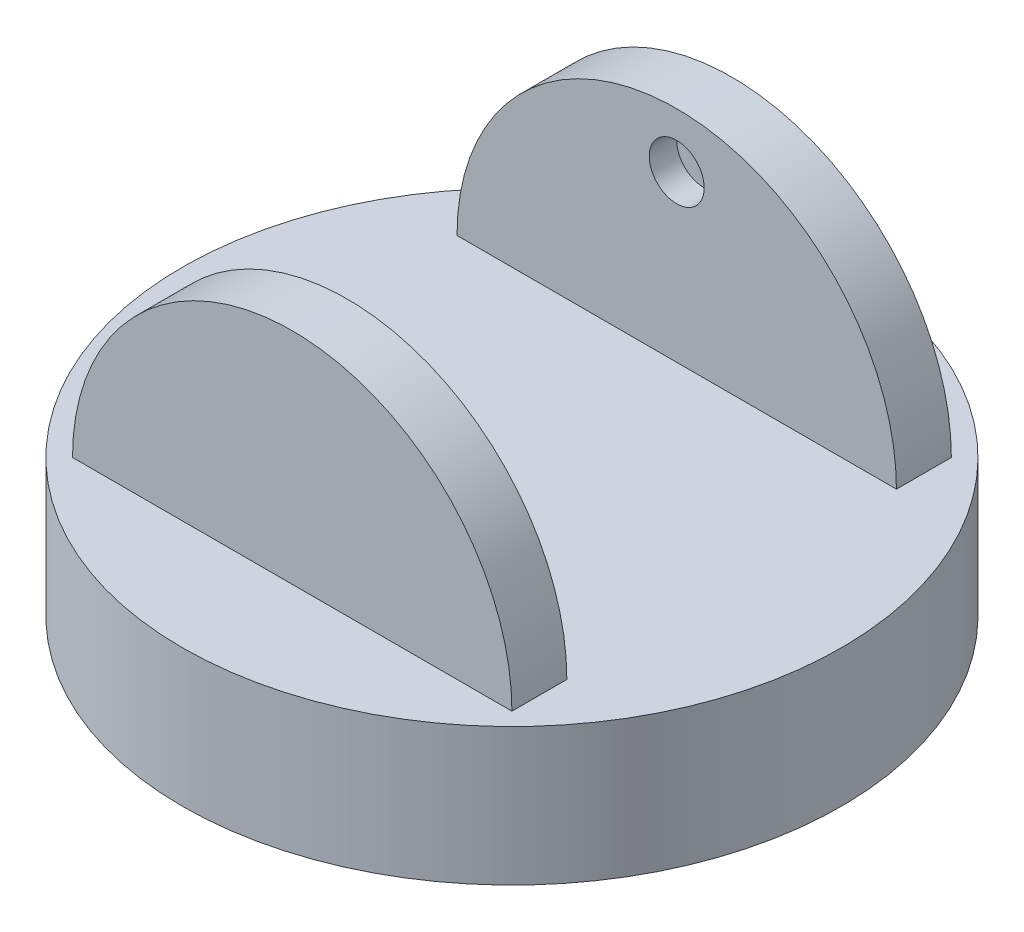
ISO-10303-21;
HEADER;
FILE_DESCRIPTION(('STEP AP214'),'2;1');
FILE_NAME('part.step','',(''),(''),'','','');
FILE_SCHEMA(('AUTOMOTIVE_DESIGN { 1 0 10303 214 1 1 1 1 }'));
ENDSEC;
DATA;
#1=APPLICATION_CONTEXT('core data for automotive mechanical design processes');
#2=APPLICATION_PROTOCOL_DEFINITION('international standard','automotive_design',2000,#1);
#3=PRODUCT_CONTEXT('',#1,'mechanical');
#4=PRODUCT('Part','Part','',(#3));
#5=PRODUCT_RELATED_PRODUCT_CATEGORY('part','',(#4));
#6=PRODUCT_DEFINITION_FORMATION('','',#4);
#7=PRODUCT_DEFINITION_CONTEXT('part definition',#1,'design');
#8=PRODUCT_DEFINITION('design','',#6,#7);
#9=PRODUCT_DEFINITION_SHAPE('','',#8);
#10=(LENGTH_UNIT() NAMED_UNIT(*) SI_UNIT(.MILLI.,.METRE.));
#11=(NAMED_UNIT(*) PLANE_ANGLE_UNIT() SI_UNIT($,.RADIAN.));
#12=(NAMED_UNIT(*) SI_UNIT($,.STERADIAN.) SOLID_ANGLE_UNIT());
#13=UNCERTAINTY_MEASURE_WITH_UNIT(LENGTH_MEASURE(1.E-05),#10,'distance_accuracy_value','');
#14=(GEOMETRIC_REPRESENTATION_CONTEXT(3) GLOBAL_UNCERTAINTY_ASSIGNED_CONTEXT((#13)) GLOBAL_UNIT_ASSIGNED_CONTEXT((#10,
#11,#12)) REPRESENTATION_CONTEXT('',''));
#15=CARTESIAN_POINT('',(0.,0.,0.));
#16=DIRECTION('',(0.,0.,1.));
#17=DIRECTION('',(1.,0.,0.));
#18=AXIS2_PLACEMENT_3D('',#15,#16,#17);
#19=CARTESIAN_POINT('',(0.,25.,40.));
#20=DIRECTION('',(0.,0.,-1.));
#21=DIRECTION('',(-1.,0.,0.));
#22=AXIS2_PLACEMENT_3D('',#19,#20,#21);
#23=CYLINDRICAL_SURFACE('',#22,40.);
#24=CARTESIAN_POINT('',(0.,25.,-30.));
#25=DIRECTION('',(0.,0.,1.));
#26=DIRECTION('',(1.,0.,0.));
#27=AXIS2_PLACEMENT_3D('',#24,#25,#26);
#28=CIRCLE('',#27,40.);
#29=CARTESIAN_POINT('',(40.,25.,-30.));
#30=VERTEX_POINT('',#29);
#31=CARTESIAN_POINT('',(-40.,25.,-30.));
#32=VERTEX_POINT('',#31);
#33=EDGE_CURVE('E11',#30,#32,#28,.T.);
#34=ORIENTED_EDGE('',*,*,#33,.F.);
#35=DIRECTION('',(0.,0.,-1.));
#36=VECTOR('',#35,1.);
#37=CARTESIAN_POINT('',(40.,25.,40.));
#38=LINE('',#37,#36);
#39=CARTESIAN_POINT('',(40.,25.,-40.));
#40=VERTEX_POINT('',#39);
#41=EDGE_CURVE('E80',#30,#40,#38,.T.);
#42=ORIENTED_EDGE('',*,*,#41,.T.);
#43=CARTESIAN_POINT('',(0.,25.,-40.));
#44=DIRECTION('',(0.,0.,1.));
#45=DIRECTION('',(-1.,0.,0.));
#46=AXIS2_PLACEMENT_3D('',#43,#44,#45);
#47=CIRCLE('',#46,40.);
#48=CARTESIAN_POINT('',(-40.,25.,-40.));
#49=VERTEX_POINT('',#48);
#50=EDGE_CURVE('E107',#40,#49,#47,.T.);
#51=ORIENTED_EDGE('',*,*,#50,.T.);
#52=DIRECTION('',(0.,0.,-1.));
#53=VECTOR('',#52,1.);
#54=CARTESIAN_POINT('',(-40.,25.,40.));
#55=LINE('',#54,#53);
#56=EDGE_CURVE('E82',#32,#49,#55,.T.);
#57=ORIENTED_EDGE('',*,*,#56,.F.);
#58=EDGE_LOOP('',(#34,#42,#51,#57));
#59=FACE_BOUND('',#58,.T.);
#60=ADVANCED_FACE('F33',(#59),#23,.T.);
#61=CARTESIAN_POINT('',(0.,25.,30.));
#62=DIRECTION('',(0.,0.,-1.));
#63=DIRECTION('',(-1.,0.,0.));
#64=AXIS2_PLACEMENT_3D('',#61,#62,#63);
#65=CIRCLE('',#64,40.);
#66=CARTESIAN_POINT('',(-40.,25.,30.));
#67=VERTEX_POINT('',#66);
#68=CARTESIAN_POINT('',(40.,25.,30.));
#69=VERTEX_POINT('',#68);
#70=EDGE_CURVE('E41',#67,#69,#65,.T.);
#71=ORIENTED_EDGE('',*,*,#70,.F.);
#72=CARTESIAN_POINT('',(-40.,25.,40.));
#73=VERTEX_POINT('',#72);
#74=EDGE_CURVE('E93',#73,#67,#55,.T.);
#75=ORIENTED_EDGE('',*,*,#74,.F.);
#76=CARTESIAN_POINT('',(0.,25.,40.));
#77=DIRECTION('',(0.,0.,1.));
#78=DIRECTION('',(-1.,0.,0.));
#79=AXIS2_PLACEMENT_3D('',#76,#77,#78);
#80=CIRCLE('',#79,40.);
#81=CARTESIAN_POINT('',(40.,25.,40.));
#82=VERTEX_POINT('',#81);
#83=EDGE_CURVE('E89',#82,#73,#80,.T.);
#84=ORIENTED_EDGE('',*,*,#83,.F.);
#85=EDGE_CURVE('E55',#82,#69,#38,.T.);
#86=ORIENTED_EDGE('',*,*,#85,.T.);
#87=EDGE_LOOP('',(#71,#75,#84,#86));
#88=FACE_BOUND('',#87,.T.);
#89=ADVANCED_FACE('F110',(#88),#23,.T.);
#90=CARTESIAN_POINT('',(0.,25.,0.));
#91=DIRECTION('',(0.,1.,0.));
#92=DIRECTION('',(0.,0.,1.));
#93=AXIS2_PLACEMENT_3D('',#90,#91,#92);
#94=PLANE('',#93);
#95=ORIENTED_EDGE('',*,*,#41,.F.);
#96=DIRECTION('',(-1.,0.,0.));
#97=VECTOR('',#96,1.);
#98=CARTESIAN_POINT('',(-40.,25.,-30.));
#99=LINE('',#98,#97);
#100=EDGE_CURVE('E48',#30,#32,#99,.T.);
#101=ORIENTED_EDGE('',*,*,#100,.T.);
#102=ORIENTED_EDGE('',*,*,#56,.T.);
#103=DIRECTION('',(1.,0.,0.));
#104=VECTOR('',#103,1.);
#105=CARTESIAN_POINT('',(0.,25.,-40.));
#106=LINE('',#105,#104);
#107=EDGE_CURVE('E86',#49,#40,#106,.T.);
#108=ORIENTED_EDGE('',*,*,#107,.T.);
#109=EDGE_LOOP('',(#95,#101,#102,#108));
#110=FACE_BOUND('',#109,.T.);
#111=ORIENTED_EDGE('',*,*,#74,.T.);
#112=DIRECTION('',(1.,0.,0.));
#113=VECTOR('',#112,1.);
#114=CARTESIAN_POINT('',(-40.,25.,30.));
#115=LINE('',#114,#113);
#116=EDGE_CURVE('E75',#67,#69,#115,.T.);
#117=ORIENTED_EDGE('',*,*,#116,.T.);
#118=ORIENTED_EDGE('',*,*,#85,.F.);
#119=DIRECTION('',(1.,0.,0.));
#120=VECTOR('',#119,1.);
#121=CARTESIAN_POINT('',(-40.,25.,40.));
#122=LINE('',#121,#120);
#123=EDGE_CURVE('E87',#73,#82,#122,.T.);
#124=ORIENTED_EDGE('',*,*,#123,.F.);
#125=EDGE_LOOP('',(#111,#117,#118,#124));
#126=FACE_BOUND('',#125,.T.);
#127=CARTESIAN_POINT('',(0.,25.,0.));
#128=DIRECTION('',(0.,1.,0.));
#129=DIRECTION('',(0.,0.,1.));
#130=AXIS2_PLACEMENT_3D('',#127,#128,#129);
#131=CIRCLE('',#130,60.);
#132=CARTESIAN_POINT('',(0.,25.,60.));
#133=VERTEX_POINT('',#132);
#134=EDGE_CURVE('E97',#133,#133,#131,.T.);
#135=ORIENTED_EDGE('',*,*,#134,.T.);
#136=EDGE_LOOP('',(#135));
#137=FACE_BOUND('',#136,.T.);
#138=ADVANCED_FACE('F84',(#110,#126,#137),#94,.T.);
#139=CARTESIAN_POINT('',(0.,25.,0.));
#140=DIRECTION('',(0.,-1.,0.));
#141=DIRECTION('',(0.,0.,-1.));
#142=AXIS2_PLACEMENT_3D('',#139,#140,#141);
#143=CYLINDRICAL_SURFACE('',#142,60.);
#144=ORIENTED_EDGE('',*,*,#134,.F.);
#145=EDGE_LOOP('',(#144));
#146=FACE_BOUND('',#145,.T.);
#147=CARTESIAN_POINT('',(0.,0.,0.));
#148=DIRECTION('',(0.,1.,0.));
#149=DIRECTION('',(0.,0.,1.));
#150=AXIS2_PLACEMENT_3D('',#147,#148,#149);
#151=CIRCLE('',#150,60.);
#152=CARTESIAN_POINT('',(0.,0.,60.));
#153=VERTEX_POINT('',#152);
#154=EDGE_CURVE('E96',#153,#153,#151,.T.);
#155=ORIENTED_EDGE('',*,*,#154,.T.);
#156=EDGE_LOOP('',(#155));
#157=FACE_BOUND('',#156,.T.);
#158=ADVANCED_FACE('F35',(#146,#157),#143,.T.);
#159=CARTESIAN_POINT('',(0.,0.,0.));
#160=DIRECTION('',(0.,1.,0.));
#161=DIRECTION('',(0.,0.,1.));
#162=AXIS2_PLACEMENT_3D('',#159,#160,#161);
#163=PLANE('',#162);
#164=ORIENTED_EDGE('',*,*,#154,.F.);
#165=EDGE_LOOP('',(#164));
#166=FACE_BOUND('',#165,.T.);
#167=ADVANCED_FACE('F149',(#166),#163,.F.);
#168=CARTESIAN_POINT('',(0.,25.,40.));
#169=DIRECTION('',(0.,0.,-1.));
#170=DIRECTION('',(-1.,0.,0.));
#171=AXIS2_PLACEMENT_3D('',#168,#169,#170);
#172=PLANE('',#171);
#173=ORIENTED_EDGE('',*,*,#83,.T.);
#174=ORIENTED_EDGE('',*,*,#123,.T.);
#175=EDGE_LOOP('',(#173,#174));
#176=FACE_BOUND('',#175,.T.);
#177=ADVANCED_FACE('F146',(#176),#172,.F.);
#178=CARTESIAN_POINT('',(0.,25.,-40.));
#179=DIRECTION('',(0.,0.,1.));
#180=DIRECTION('',(-1.,0.,0.));
#181=AXIS2_PLACEMENT_3D('',#178,#179,#180);
#182=PLANE('',#181);
#183=ORIENTED_EDGE('',*,*,#50,.F.);
#184=ORIENTED_EDGE('',*,*,#107,.F.);
#185=EDGE_LOOP('',(#183,#184));
#186=FACE_BOUND('',#185,.T.);
#187=ADVANCED_FACE('F156',(#186),#182,.F.);
#188=CARTESIAN_POINT('',(-40.,85.,-30.));
#189=DIRECTION('',(0.,0.,1.));
#190=DIRECTION('',(1.,0.,0.));
#191=AXIS2_PLACEMENT_3D('',#188,#189,#190);
#192=PLANE('',#191);
#193=CARTESIAN_POINT('',(0.,55.,-30.));
#194=DIRECTION('',(0.,0.,1.));
#195=DIRECTION('',(1.,0.,0.));
#196=AXIS2_PLACEMENT_3D('',#193,#194,#195);
#197=CIRCLE('',#196,5.);
#198=CARTESIAN_POINT('',(5.,55.,-30.));
#199=VERTEX_POINT('',#198);
#200=EDGE_CURVE('E116',#199,#199,#197,.T.);
#201=ORIENTED_EDGE('',*,*,#200,.F.);
#202=EDGE_LOOP('',(#201));
#203=FACE_BOUND('',#202,.T.);
#204=ORIENTED_EDGE('',*,*,#33,.T.);
#205=ORIENTED_EDGE('',*,*,#100,.F.);
#206=EDGE_LOOP('',(#204,#205));
#207=FACE_BOUND('',#206,.T.);
#208=ADVANCED_FACE('F73',(#203,#207),#192,.T.);
#209=CARTESIAN_POINT('',(-40.,85.,30.));
#210=DIRECTION('',(0.,0.,-1.));
#211=DIRECTION('',(-1.,0.,0.));
#212=AXIS2_PLACEMENT_3D('',#209,#210,#211);
#213=PLANE('',#212);
#214=CARTESIAN_POINT('',(0.,55.,30.));
#215=DIRECTION('',(0.,0.,1.));
#216=DIRECTION('',(1.,0.,0.));
#217=AXIS2_PLACEMENT_3D('',#214,#215,#216);
#218=CIRCLE('',#217,5.);
#219=CARTESIAN_POINT('',(5.,55.,30.));
#220=VERTEX_POINT('',#219);
#221=EDGE_CURVE('E122',#220,#220,#218,.T.);
#222=ORIENTED_EDGE('',*,*,#221,.T.);
#223=EDGE_LOOP('',(#222));
#224=FACE_BOUND('',#223,.T.);
#225=ORIENTED_EDGE('',*,*,#70,.T.);
#226=ORIENTED_EDGE('',*,*,#116,.F.);
#227=EDGE_LOOP('',(#225,#226));
#228=FACE_BOUND('',#227,.T.);
#229=ADVANCED_FACE('F103',(#224,#228),#213,.T.);
#230=CARTESIAN_POINT('',(0.,55.,-35.));
#231=DIRECTION('',(0.,0.,1.));
#232=DIRECTION('',(1.,0.,0.));
#233=AXIS2_PLACEMENT_3D('',#230,#231,#232);
#234=CYLINDRICAL_SURFACE('',#233,5.);
#235=CARTESIAN_POINT('',(0.,55.,-35.));
#236=DIRECTION('',(0.,0.,1.));
#237=DIRECTION('',(1.,0.,0.));
#238=AXIS2_PLACEMENT_3D('',#235,#236,#237);
#239=CIRCLE('',#238,5.);
#240=CARTESIAN_POINT('',(5.,55.,-35.));
#241=VERTEX_POINT('',#240);
#242=EDGE_CURVE('E76',#241,#241,#239,.T.);
#243=ORIENTED_EDGE('',*,*,#242,.F.);
#244=EDGE_LOOP('',(#243));
#245=FACE_BOUND('',#244,.T.);
#246=ORIENTED_EDGE('',*,*,#200,.T.);
#247=EDGE_LOOP('',(#246));
#248=FACE_BOUND('',#247,.T.);
#249=ADVANCED_FACE('F221',(#245,#248),#234,.F.);
#250=CARTESIAN_POINT('',(0.,55.,-35.));
#251=DIRECTION('',(0.,0.,1.));
#252=DIRECTION('',(1.,0.,0.));
#253=AXIS2_PLACEMENT_3D('',#250,#251,#252);
#254=PLANE('',#253);
#255=ORIENTED_EDGE('',*,*,#242,.T.);
#256=EDGE_LOOP('',(#255));
#257=FACE_BOUND('',#256,.T.);
#258=ADVANCED_FACE('F137',(#257),#254,.T.);
#259=CARTESIAN_POINT('',(0.,55.,35.));
#260=DIRECTION('',(0.,0.,-1.));
#261=DIRECTION('',(-1.,0.,0.));
#262=AXIS2_PLACEMENT_3D('',#259,#260,#261);
#263=CYLINDRICAL_SURFACE('',#262,5.);
#264=CARTESIAN_POINT('',(0.,55.,35.));
#265=DIRECTION('',(0.,0.,1.));
#266=DIRECTION('',(1.,0.,0.));
#267=AXIS2_PLACEMENT_3D('',#264,#265,#266);
#268=CIRCLE('',#267,5.);
#269=CARTESIAN_POINT('',(5.,55.,35.));
#270=VERTEX_POINT('',#269);
#271=EDGE_CURVE('E119',#270,#270,#268,.T.);
#272=ORIENTED_EDGE('',*,*,#271,.T.);
#273=EDGE_LOOP('',(#272));
#274=FACE_BOUND('',#273,.T.);
#275=ORIENTED_EDGE('',*,*,#221,.F.);
#276=EDGE_LOOP('',(#275));
#277=FACE_BOUND('',#276,.T.);
#278=ADVANCED_FACE('F128',(#274,#277),#263,.F.);
#279=CARTESIAN_POINT('',(0.,55.,35.));
#280=DIRECTION('',(0.,0.,-1.));
#281=DIRECTION('',(1.,0.,0.));
#282=AXIS2_PLACEMENT_3D('',#279,#280,#281);
#283=PLANE('',#282);
#284=ORIENTED_EDGE('',*,*,#271,.F.);
#285=EDGE_LOOP('',(#284));
#286=FACE_BOUND('',#285,.T.);
#287=ADVANCED_FACE('F131',(#286),#283,.T.);
#288=CLOSED_SHELL('',(#60,#89,#138,#158,#167,#177,#187,#208,#229,#249,#258,#278,#287));
#289=MANIFOLD_SOLID_BREP('B2',#288);
#290=ADVANCED_BREP_SHAPE_REPRESENTATION('',(#18,#289),#14);
#291=SHAPE_DEFINITION_REPRESENTATION(#9,#290);
ENDSEC;
END-ISO-10303-21;
